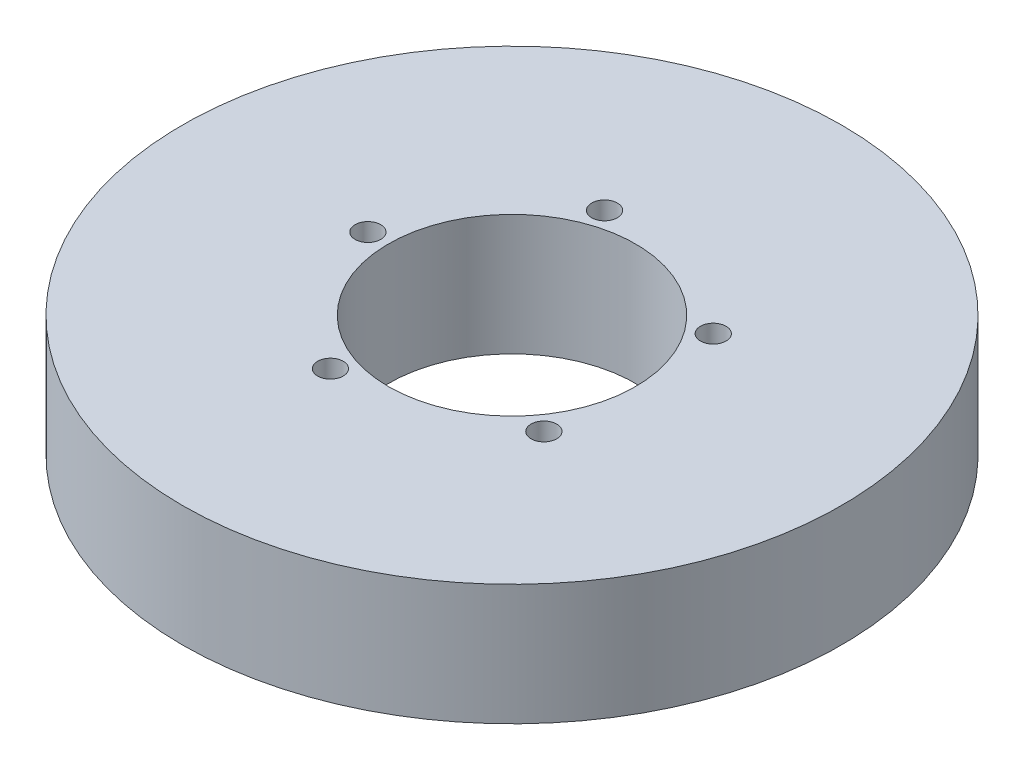
ISO-10303-21;
HEADER;
FILE_DESCRIPTION(('STEP AP214'),'2;1');
FILE_NAME('part.step','',(''),(''),'','','');
FILE_SCHEMA(('AUTOMOTIVE_DESIGN { 1 0 10303 214 1 1 1 1 }'));
ENDSEC;
DATA;
#1=APPLICATION_CONTEXT('core data for automotive mechanical design processes');
#2=APPLICATION_PROTOCOL_DEFINITION('international standard','automotive_design',2000,#1);
#3=PRODUCT_CONTEXT('',#1,'mechanical');
#4=PRODUCT('Part','Part','',(#3));
#5=PRODUCT_RELATED_PRODUCT_CATEGORY('part','',(#4));
#6=PRODUCT_DEFINITION_FORMATION('','',#4);
#7=PRODUCT_DEFINITION_CONTEXT('part definition',#1,'design');
#8=PRODUCT_DEFINITION('design','',#6,#7);
#9=PRODUCT_DEFINITION_SHAPE('','',#8);
#10=(LENGTH_UNIT() NAMED_UNIT(*) SI_UNIT(.MILLI.,.METRE.));
#11=(NAMED_UNIT(*) PLANE_ANGLE_UNIT() SI_UNIT($,.RADIAN.));
#12=(NAMED_UNIT(*) SI_UNIT($,.STERADIAN.) SOLID_ANGLE_UNIT());
#13=UNCERTAINTY_MEASURE_WITH_UNIT(LENGTH_MEASURE(1.E-05),#10,'distance_accuracy_value','');
#14=(GEOMETRIC_REPRESENTATION_CONTEXT(3) GLOBAL_UNCERTAINTY_ASSIGNED_CONTEXT((#13)) GLOBAL_UNIT_ASSIGNED_CONTEXT((#10,
#11,#12)) REPRESENTATION_CONTEXT('',''));
#15=CARTESIAN_POINT('',(0.,0.,0.));
#16=DIRECTION('',(0.,0.,1.));
#17=DIRECTION('',(1.,0.,0.));
#18=AXIS2_PLACEMENT_3D('',#15,#16,#17);
#19=CARTESIAN_POINT('',(0.,22.,0.));
#20=DIRECTION('',(0.,-1.,0.));
#21=DIRECTION('',(0.,0.,-1.));
#22=AXIS2_PLACEMENT_3D('',#19,#20,#21);
#23=CYLINDRICAL_SURFACE('',#22,60.);
#24=CARTESIAN_POINT('',(0.,22.,0.));
#25=DIRECTION('',(0.,1.,0.));
#26=DIRECTION('',(0.,0.,1.));
#27=AXIS2_PLACEMENT_3D('',#24,#25,#26);
#28=CIRCLE('',#27,60.);
#29=CARTESIAN_POINT('',(0.,22.,60.));
#30=VERTEX_POINT('',#29);
#31=EDGE_CURVE('E10',#30,#30,#28,.T.);
#32=ORIENTED_EDGE('',*,*,#31,.F.);
#33=EDGE_LOOP('',(#32));
#34=FACE_BOUND('',#33,.T.);
#35=CARTESIAN_POINT('',(0.,0.,0.));
#36=DIRECTION('',(0.,1.,0.));
#37=DIRECTION('',(0.,0.,1.));
#38=AXIS2_PLACEMENT_3D('',#35,#36,#37);
#39=CIRCLE('',#38,60.);
#40=CARTESIAN_POINT('',(0.,0.,60.));
#41=VERTEX_POINT('',#40);
#42=EDGE_CURVE('E37',#41,#41,#39,.T.);
#43=ORIENTED_EDGE('',*,*,#42,.T.);
#44=EDGE_LOOP('',(#43));
#45=FACE_BOUND('',#44,.T.);
#46=ADVANCED_FACE('F40',(#34,#45),#23,.T.);
#47=CARTESIAN_POINT('',(0.,22.,0.));
#48=DIRECTION('',(0.,1.,0.));
#49=DIRECTION('',(0.,0.,1.));
#50=AXIS2_PLACEMENT_3D('',#47,#48,#49);
#51=PLANE('',#50);
#52=CARTESIAN_POINT('',(-8.10685700799198,22.,24.950340351731));
#53=DIRECTION('',(0.,1.,0.));
#54=DIRECTION('',(0.951056516295155,0.,0.309016994374945));
#55=AXIS2_PLACEMENT_3D('',#52,#53,#54);
#56=CIRCLE('',#55,2.33608327444534);
#57=CARTESIAN_POINT('',(-5.88510978722262,22.,25.6722297838097));
#58=VERTEX_POINT('',#57);
#59=EDGE_CURVE('E78',#58,#58,#56,.T.);
#60=ORIENTED_EDGE('',*,*,#59,.F.);
#61=EDGE_LOOP('',(#60));
#62=FACE_BOUND('',#61,.T.);
#63=CARTESIAN_POINT('',(21.2240271888585,22.,15.4201583682476));
#64=DIRECTION('',(0.,1.,0.));
#65=DIRECTION('',(0.587785252292469,0.,-0.809016994374951));
#66=AXIS2_PLACEMENT_3D('',#63,#64,#65);
#67=CIRCLE('',#66,2.33608327444534);
#68=CARTESIAN_POINT('',(22.5971424857046,22.,13.5302272989463));
#69=VERTEX_POINT('',#68);
#70=EDGE_CURVE('E71',#69,#69,#67,.T.);
#71=ORIENTED_EDGE('',*,*,#70,.F.);
#72=EDGE_LOOP('',(#71));
#73=FACE_BOUND('',#72,.T.);
#74=CARTESIAN_POINT('',(21.2240271888583,22.,-15.4201583682479));
#75=DIRECTION('',(0.,1.,0.));
#76=DIRECTION('',(-0.58778525229248,0.,-0.809016994374942));
#77=AXIS2_PLACEMENT_3D('',#74,#75,#76);
#78=CIRCLE('',#77,2.33608327444534);
#79=CARTESIAN_POINT('',(19.8509118920122,22.,-17.3100894375493));
#80=VERTEX_POINT('',#79);
#81=EDGE_CURVE('E70',#80,#80,#78,.T.);
#82=ORIENTED_EDGE('',*,*,#81,.F.);
#83=EDGE_LOOP('',(#82));
#84=FACE_BOUND('',#83,.T.);
#85=CARTESIAN_POINT('',(-8.10685700799233,22.,-24.9503403517309));
#86=DIRECTION('',(0.,1.,0.));
#87=DIRECTION('',(-0.95105651629515,0.,0.309016994374958));
#88=AXIS2_PLACEMENT_3D('',#85,#86,#87);
#89=CIRCLE('',#88,2.33608327444534);
#90=CARTESIAN_POINT('',(-10.3286042287617,22.,-24.2284509196522));
#91=VERTEX_POINT('',#90);
#92=EDGE_CURVE('E61',#91,#91,#89,.T.);
#93=ORIENTED_EDGE('',*,*,#92,.F.);
#94=EDGE_LOOP('',(#93));
#95=FACE_BOUND('',#94,.T.);
#96=CARTESIAN_POINT('',(-26.2343403617328,22.,0.));
#97=DIRECTION('',(0.,1.,0.));
#98=DIRECTION('',(0.,0.,1.));
#99=AXIS2_PLACEMENT_3D('',#96,#97,#98);
#100=CIRCLE('',#99,2.33608327444534);
#101=CARTESIAN_POINT('',(-26.2343403617328,22.,2.33608327444534));
#102=VERTEX_POINT('',#101);
#103=EDGE_CURVE('E54',#102,#102,#100,.T.);
#104=ORIENTED_EDGE('',*,*,#103,.F.);
#105=EDGE_LOOP('',(#104));
#106=FACE_BOUND('',#105,.T.);
#107=CARTESIAN_POINT('',(0.,22.,0.));
#108=DIRECTION('',(0.,1.,0.));
#109=DIRECTION('',(0.,0.,1.));
#110=AXIS2_PLACEMENT_3D('',#107,#108,#109);
#111=CIRCLE('',#110,22.5);
#112=CARTESIAN_POINT('',(0.,22.,22.5));
#113=VERTEX_POINT('',#112);
#114=EDGE_CURVE('E50',#113,#113,#111,.T.);
#115=ORIENTED_EDGE('',*,*,#114,.F.);
#116=EDGE_LOOP('',(#115));
#117=FACE_BOUND('',#116,.T.);
#118=ORIENTED_EDGE('',*,*,#31,.T.);
#119=EDGE_LOOP('',(#118));
#120=FACE_BOUND('',#119,.T.);
#121=ADVANCED_FACE('F94',(#62,#73,#84,#95,#106,#117,#120),#51,.T.);
#122=CARTESIAN_POINT('',(0.,0.,0.));
#123=DIRECTION('',(0.,1.,0.));
#124=DIRECTION('',(0.,0.,1.));
#125=AXIS2_PLACEMENT_3D('',#122,#123,#124);
#126=PLANE('',#125);
#127=CARTESIAN_POINT('',(0.,0.,0.));
#128=DIRECTION('',(0.,1.,0.));
#129=DIRECTION('',(0.,0.,1.));
#130=AXIS2_PLACEMENT_3D('',#127,#128,#129);
#131=CIRCLE('',#130,22.5);
#132=CARTESIAN_POINT('',(0.,0.,22.5));
#133=VERTEX_POINT('',#132);
#134=EDGE_CURVE('E47',#133,#133,#131,.T.);
#135=ORIENTED_EDGE('',*,*,#134,.T.);
#136=EDGE_LOOP('',(#135));
#137=FACE_BOUND('',#136,.T.);
#138=ORIENTED_EDGE('',*,*,#42,.F.);
#139=EDGE_LOOP('',(#138));
#140=FACE_BOUND('',#139,.T.);
#141=ADVANCED_FACE('F100',(#137,#140),#126,.F.);
#142=CARTESIAN_POINT('',(0.,22.,0.));
#143=DIRECTION('',(0.,-1.,0.));
#144=DIRECTION('',(0.,0.,-1.));
#145=AXIS2_PLACEMENT_3D('',#142,#143,#144);
#146=CYLINDRICAL_SURFACE('',#145,22.5);
#147=ORIENTED_EDGE('',*,*,#114,.T.);
#148=EDGE_LOOP('',(#147));
#149=FACE_BOUND('',#148,.T.);
#150=ORIENTED_EDGE('',*,*,#134,.F.);
#151=EDGE_LOOP('',(#150));
#152=FACE_BOUND('',#151,.T.);
#153=ADVANCED_FACE('F108',(#149,#152),#146,.F.);
#154=CARTESIAN_POINT('',(-26.2343403617328,1.95839867045448,0.));
#155=DIRECTION('',(0.,1.,0.));
#156=DIRECTION('',(0.,0.,1.));
#157=AXIS2_PLACEMENT_3D('',#154,#155,#156);
#158=CYLINDRICAL_SURFACE('',#157,2.33608327444534);
#159=CARTESIAN_POINT('',(-26.2343403617328,1.95839867045448,0.));
#160=DIRECTION('',(0.,1.,0.));
#161=DIRECTION('',(0.,0.,1.));
#162=AXIS2_PLACEMENT_3D('',#159,#160,#161);
#163=CIRCLE('',#162,2.33608327444534);
#164=CARTESIAN_POINT('',(-26.2343403617328,1.95839867045448,2.33608327444534));
#165=VERTEX_POINT('',#164);
#166=EDGE_CURVE('E55',#165,#165,#163,.T.);
#167=ORIENTED_EDGE('',*,*,#166,.F.);
#168=EDGE_LOOP('',(#167));
#169=FACE_BOUND('',#168,.T.);
#170=ORIENTED_EDGE('',*,*,#103,.T.);
#171=EDGE_LOOP('',(#170));
#172=FACE_BOUND('',#171,.T.);
#173=ADVANCED_FACE('F115',(#169,#172),#158,.F.);
#174=CARTESIAN_POINT('',(-26.2343403617328,1.95839867045448,0.));
#175=DIRECTION('',(0.,1.,0.));
#176=DIRECTION('',(0.,0.,1.));
#177=AXIS2_PLACEMENT_3D('',#174,#175,#176);
#178=PLANE('',#177);
#179=ORIENTED_EDGE('',*,*,#166,.T.);
#180=EDGE_LOOP('',(#179));
#181=FACE_BOUND('',#180,.T.);
#182=ADVANCED_FACE('F142',(#181),#178,.T.);
#183=CARTESIAN_POINT('',(-8.10685700799233,1.95839867045448,-24.9503403517309));
#184=DIRECTION('',(0.,1.,0.));
#185=DIRECTION('',(0.,0.,1.));
#186=AXIS2_PLACEMENT_3D('',#183,#184,#185);
#187=CYLINDRICAL_SURFACE('',#186,2.33608327444534);
#188=CARTESIAN_POINT('',(-8.10685700799233,1.95839867045448,-24.9503403517309));
#189=DIRECTION('',(0.,1.,0.));
#190=DIRECTION('',(-0.95105651629515,0.,0.309016994374958));
#191=AXIS2_PLACEMENT_3D('',#188,#189,#190);
#192=CIRCLE('',#191,2.33608327444534);
#193=CARTESIAN_POINT('',(-10.3286042287617,1.95839867045448,-24.2284509196522));
#194=VERTEX_POINT('',#193);
#195=EDGE_CURVE('E63',#194,#194,#192,.T.);
#196=ORIENTED_EDGE('',*,*,#195,.F.);
#197=EDGE_LOOP('',(#196));
#198=FACE_BOUND('',#197,.T.);
#199=ORIENTED_EDGE('',*,*,#92,.T.);
#200=EDGE_LOOP('',(#199));
#201=FACE_BOUND('',#200,.T.);
#202=ADVANCED_FACE('F147',(#198,#201),#187,.F.);
#203=CARTESIAN_POINT('',(-8.10685700799233,1.95839867045448,-24.9503403517309));
#204=DIRECTION('',(0.,1.,0.));
#205=DIRECTION('',(-0.95105651629515,0.,0.309016994374958));
#206=AXIS2_PLACEMENT_3D('',#203,#204,#205);
#207=PLANE('',#206);
#208=ORIENTED_EDGE('',*,*,#195,.T.);
#209=EDGE_LOOP('',(#208));
#210=FACE_BOUND('',#209,.T.);
#211=ADVANCED_FACE('F163',(#210),#207,.T.);
#212=CARTESIAN_POINT('',(21.2240271888583,1.95839867045448,-15.4201583682479));
#213=DIRECTION('',(0.,1.,0.));
#214=DIRECTION('',(0.,0.,1.));
#215=AXIS2_PLACEMENT_3D('',#212,#213,#214);
#216=CYLINDRICAL_SURFACE('',#215,2.33608327444534);
#217=CARTESIAN_POINT('',(21.2240271888583,1.95839867045448,-15.4201583682479));
#218=DIRECTION('',(0.,1.,0.));
#219=DIRECTION('',(-0.58778525229248,0.,-0.809016994374942));
#220=AXIS2_PLACEMENT_3D('',#217,#218,#219);
#221=CIRCLE('',#220,2.33608327444534);
#222=CARTESIAN_POINT('',(19.8509118920122,1.95839867045448,-17.3100894375493));
#223=VERTEX_POINT('',#222);
#224=EDGE_CURVE('E69',#223,#223,#221,.T.);
#225=ORIENTED_EDGE('',*,*,#224,.F.);
#226=EDGE_LOOP('',(#225));
#227=FACE_BOUND('',#226,.T.);
#228=ORIENTED_EDGE('',*,*,#81,.T.);
#229=EDGE_LOOP('',(#228));
#230=FACE_BOUND('',#229,.T.);
#231=ADVANCED_FACE('F172',(#227,#230),#216,.F.);
#232=CARTESIAN_POINT('',(21.2240271888583,1.95839867045448,-15.4201583682479));
#233=DIRECTION('',(0.,1.,0.));
#234=DIRECTION('',(-0.58778525229248,0.,-0.809016994374942));
#235=AXIS2_PLACEMENT_3D('',#232,#233,#234);
#236=PLANE('',#235);
#237=ORIENTED_EDGE('',*,*,#224,.T.);
#238=EDGE_LOOP('',(#237));
#239=FACE_BOUND('',#238,.T.);
#240=ADVANCED_FACE('F185',(#239),#236,.T.);
#241=CARTESIAN_POINT('',(21.2240271888585,1.95839867045448,15.4201583682476));
#242=DIRECTION('',(0.,1.,0.));
#243=DIRECTION('',(0.,0.,1.));
#244=AXIS2_PLACEMENT_3D('',#241,#242,#243);
#245=CYLINDRICAL_SURFACE('',#244,2.33608327444534);
#246=CARTESIAN_POINT('',(21.2240271888585,1.95839867045448,15.4201583682476));
#247=DIRECTION('',(0.,1.,0.));
#248=DIRECTION('',(0.587785252292469,0.,-0.809016994374951));
#249=AXIS2_PLACEMENT_3D('',#246,#247,#248);
#250=CIRCLE('',#249,2.33608327444534);
#251=CARTESIAN_POINT('',(22.5971424857046,1.95839867045448,13.5302272989463));
#252=VERTEX_POINT('',#251);
#253=EDGE_CURVE('E76',#252,#252,#250,.T.);
#254=ORIENTED_EDGE('',*,*,#253,.F.);
#255=EDGE_LOOP('',(#254));
#256=FACE_BOUND('',#255,.T.);
#257=ORIENTED_EDGE('',*,*,#70,.T.);
#258=EDGE_LOOP('',(#257));
#259=FACE_BOUND('',#258,.T.);
#260=ADVANCED_FACE('F191',(#256,#259),#245,.F.);
#261=CARTESIAN_POINT('',(21.2240271888585,1.95839867045448,15.4201583682476));
#262=DIRECTION('',(0.,1.,0.));
#263=DIRECTION('',(0.587785252292469,0.,-0.809016994374951));
#264=AXIS2_PLACEMENT_3D('',#261,#262,#263);
#265=PLANE('',#264);
#266=ORIENTED_EDGE('',*,*,#253,.T.);
#267=EDGE_LOOP('',(#266));
#268=FACE_BOUND('',#267,.T.);
#269=ADVANCED_FACE('F89',(#268),#265,.T.);
#270=CARTESIAN_POINT('',(-8.10685700799198,1.95839867045448,24.950340351731));
#271=DIRECTION('',(0.,1.,0.));
#272=DIRECTION('',(0.,0.,1.));
#273=AXIS2_PLACEMENT_3D('',#270,#271,#272);
#274=CYLINDRICAL_SURFACE('',#273,2.33608327444534);
#275=CARTESIAN_POINT('',(-8.10685700799198,1.95839867045448,24.950340351731));
#276=DIRECTION('',(0.,1.,0.));
#277=DIRECTION('',(0.951056516295155,0.,0.309016994374945));
#278=AXIS2_PLACEMENT_3D('',#275,#276,#277);
#279=CIRCLE('',#278,2.33608327444534);
#280=CARTESIAN_POINT('',(-5.88510978722262,1.95839867045448,25.6722297838097));
#281=VERTEX_POINT('',#280);
#282=EDGE_CURVE('E59',#281,#281,#279,.T.);
#283=ORIENTED_EDGE('',*,*,#282,.F.);
#284=EDGE_LOOP('',(#283));
#285=FACE_BOUND('',#284,.T.);
#286=ORIENTED_EDGE('',*,*,#59,.T.);
#287=EDGE_LOOP('',(#286));
#288=FACE_BOUND('',#287,.T.);
#289=ADVANCED_FACE('F87',(#285,#288),#274,.F.);
#290=CARTESIAN_POINT('',(-8.10685700799198,1.95839867045448,24.950340351731));
#291=DIRECTION('',(0.,1.,0.));
#292=DIRECTION('',(0.951056516295155,0.,0.309016994374945));
#293=AXIS2_PLACEMENT_3D('',#290,#291,#292);
#294=PLANE('',#293);
#295=ORIENTED_EDGE('',*,*,#282,.T.);
#296=EDGE_LOOP('',(#295));
#297=FACE_BOUND('',#296,.T.);
#298=ADVANCED_FACE('F84',(#297),#294,.T.);
#299=CLOSED_SHELL('',(#46,#121,#141,#153,#173,#182,#202,#211,#231,#240,#260,#269,#289,#298));
#300=MANIFOLD_SOLID_BREP('B2',#299);
#301=ADVANCED_BREP_SHAPE_REPRESENTATION('',(#18,#300),#14);
#302=SHAPE_DEFINITION_REPRESENTATION(#9,#301);
ENDSEC;
END-ISO-10303-21;
